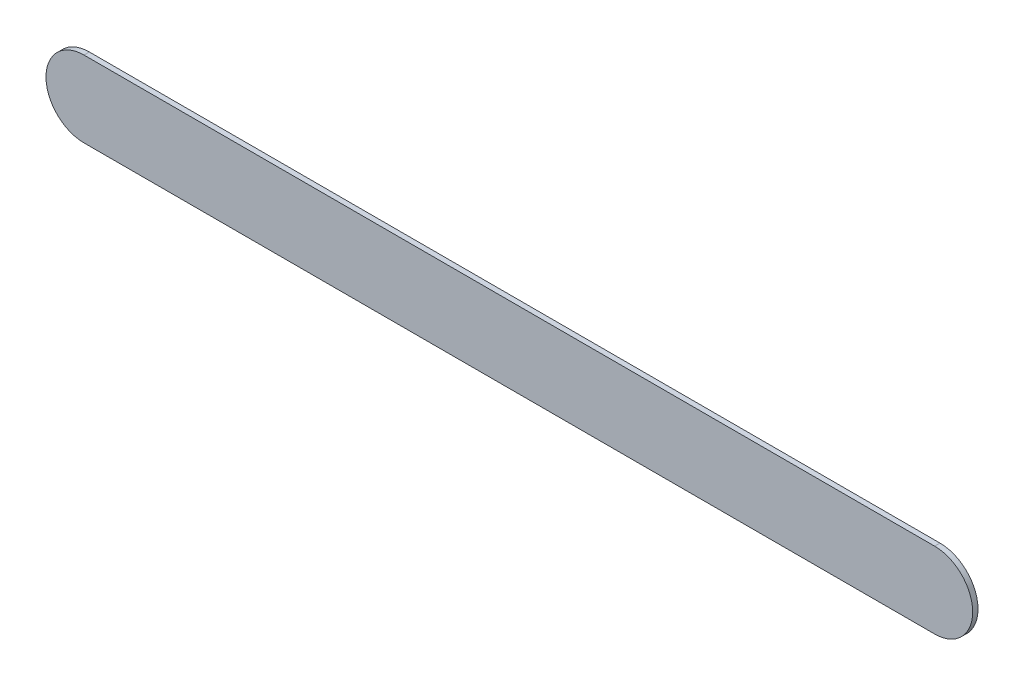
ISO-10303-21;
HEADER;
FILE_DESCRIPTION(('STEP AP214'),'2;1');
FILE_NAME('part.step','',(''),(''),'','','');
FILE_SCHEMA(('AUTOMOTIVE_DESIGN { 1 0 10303 214 1 1 1 1 }'));
ENDSEC;
DATA;
#1=APPLICATION_CONTEXT('core data for automotive mechanical design processes');
#2=APPLICATION_PROTOCOL_DEFINITION('international standard','automotive_design',2000,#1);
#3=PRODUCT_CONTEXT('',#1,'mechanical');
#4=PRODUCT('Part','Part','',(#3));
#5=PRODUCT_RELATED_PRODUCT_CATEGORY('part','',(#4));
#6=PRODUCT_DEFINITION_FORMATION('','',#4);
#7=PRODUCT_DEFINITION_CONTEXT('part definition',#1,'design');
#8=PRODUCT_DEFINITION('design','',#6,#7);
#9=PRODUCT_DEFINITION_SHAPE('','',#8);
#10=(LENGTH_UNIT() NAMED_UNIT(*) SI_UNIT(.MILLI.,.METRE.));
#11=(NAMED_UNIT(*) PLANE_ANGLE_UNIT() SI_UNIT($,.RADIAN.));
#12=(NAMED_UNIT(*) SI_UNIT($,.STERADIAN.) SOLID_ANGLE_UNIT());
#13=UNCERTAINTY_MEASURE_WITH_UNIT(LENGTH_MEASURE(1.E-05),#10,'distance_accuracy_value','');
#14=(GEOMETRIC_REPRESENTATION_CONTEXT(3) GLOBAL_UNCERTAINTY_ASSIGNED_CONTEXT((#13)) GLOBAL_UNIT_ASSIGNED_CONTEXT((#10,
#11,#12)) REPRESENTATION_CONTEXT('',''));
#15=CARTESIAN_POINT('',(0.,0.,0.));
#16=DIRECTION('',(0.,0.,1.));
#17=DIRECTION('',(1.,0.,0.));
#18=AXIS2_PLACEMENT_3D('',#15,#16,#17);
#19=CARTESIAN_POINT('',(137.922,-110.232,0.));
#20=DIRECTION('',(0.,0.,1.));
#21=DIRECTION('',(1.,0.,0.));
#22=AXIS2_PLACEMENT_3D('',#19,#20,#21);
#23=PLANE('',#22);
#24=DIRECTION('',(1.,0.,0.));
#25=VECTOR('',#24,1.);
#26=CARTESIAN_POINT('',(137.922,-110.232,0.));
#27=LINE('',#26,#25);
#28=CARTESIAN_POINT('',(137.922,-110.232,0.));
#29=VERTEX_POINT('',#28);
#30=CARTESIAN_POINT('',(143.51,-110.232,0.));
#31=VERTEX_POINT('',#30);
#32=EDGE_CURVE('E83',#29,#31,#27,.T.);
#33=ORIENTED_EDGE('',*,*,#32,.T.);
#34=CARTESIAN_POINT('',(143.51,-109.982,0.));
#35=DIRECTION('',(0.,0.,1.));
#36=DIRECTION('',(0.,-1.,0.));
#37=AXIS2_PLACEMENT_3D('',#34,#35,#36);
#38=CIRCLE('',#37,0.25);
#39=CARTESIAN_POINT('',(143.51,-109.732,0.));
#40=VERTEX_POINT('',#39);
#41=EDGE_CURVE('E107',#31,#40,#38,.T.);
#42=ORIENTED_EDGE('',*,*,#41,.T.);
#43=DIRECTION('',(-1.,0.,0.));
#44=VECTOR('',#43,1.);
#45=CARTESIAN_POINT('',(143.51,-109.732,0.));
#46=LINE('',#45,#44);
#47=CARTESIAN_POINT('',(137.922,-109.732,0.));
#48=VERTEX_POINT('',#47);
#49=EDGE_CURVE('E76',#40,#48,#46,.T.);
#50=ORIENTED_EDGE('',*,*,#49,.T.);
#51=CARTESIAN_POINT('',(137.922,-109.982,0.));
#52=DIRECTION('',(0.,0.,1.));
#53=DIRECTION('',(0.,1.,0.));
#54=AXIS2_PLACEMENT_3D('',#51,#52,#53);
#55=CIRCLE('',#54,0.25);
#56=EDGE_CURVE('E11',#48,#29,#55,.T.);
#57=ORIENTED_EDGE('',*,*,#56,.T.);
#58=EDGE_LOOP('',(#33,#42,#50,#57));
#59=FACE_BOUND('',#58,.T.);
#60=ADVANCED_FACE('F17',(#59),#23,.T.);
#61=CARTESIAN_POINT('',(137.922,-110.232,-0.035));
#62=DIRECTION('',(0.,0.,1.));
#63=DIRECTION('',(1.,0.,0.));
#64=AXIS2_PLACEMENT_3D('',#61,#62,#63);
#65=PLANE('',#64);
#66=CARTESIAN_POINT('',(137.922,-109.982,-0.035));
#67=DIRECTION('',(0.,0.,1.));
#68=DIRECTION('',(0.,1.,0.));
#69=AXIS2_PLACEMENT_3D('',#66,#67,#68);
#70=CIRCLE('',#69,0.25);
#71=CARTESIAN_POINT('',(137.922,-109.732,-0.035));
#72=VERTEX_POINT('',#71);
#73=CARTESIAN_POINT('',(137.922,-110.232,-0.035));
#74=VERTEX_POINT('',#73);
#75=EDGE_CURVE('E27',#72,#74,#70,.T.);
#76=ORIENTED_EDGE('',*,*,#75,.F.);
#77=DIRECTION('',(-1.,0.,0.));
#78=VECTOR('',#77,1.);
#79=CARTESIAN_POINT('',(143.51,-109.732,-0.035));
#80=LINE('',#79,#78);
#81=CARTESIAN_POINT('',(143.51,-109.732,-0.035));
#82=VERTEX_POINT('',#81);
#83=EDGE_CURVE('E112',#82,#72,#80,.T.);
#84=ORIENTED_EDGE('',*,*,#83,.F.);
#85=CARTESIAN_POINT('',(143.51,-109.982,-0.035));
#86=DIRECTION('',(0.,0.,1.));
#87=DIRECTION('',(0.,-1.,0.));
#88=AXIS2_PLACEMENT_3D('',#85,#86,#87);
#89=CIRCLE('',#88,0.25);
#90=CARTESIAN_POINT('',(143.51,-110.232,-0.035));
#91=VERTEX_POINT('',#90);
#92=EDGE_CURVE('E85',#91,#82,#89,.T.);
#93=ORIENTED_EDGE('',*,*,#92,.F.);
#94=DIRECTION('',(1.,0.,0.));
#95=VECTOR('',#94,1.);
#96=CARTESIAN_POINT('',(137.922,-110.232,-0.035));
#97=LINE('',#96,#95);
#98=EDGE_CURVE('E81',#74,#91,#97,.T.);
#99=ORIENTED_EDGE('',*,*,#98,.F.);
#100=EDGE_LOOP('',(#76,#84,#93,#99));
#101=FACE_BOUND('',#100,.T.);
#102=ADVANCED_FACE('F19',(#101),#65,.F.);
#103=CARTESIAN_POINT('',(137.922,-109.982,-0.035));
#104=DIRECTION('',(0.,0.,-1.));
#105=DIRECTION('',(0.,1.,0.));
#106=AXIS2_PLACEMENT_3D('',#103,#104,#105);
#107=CYLINDRICAL_SURFACE('',#106,0.25);
#108=ORIENTED_EDGE('',*,*,#75,.T.);
#109=DIRECTION('',(0.,0.,1.));
#110=VECTOR('',#109,1.);
#111=CARTESIAN_POINT('',(137.922,-110.232,-0.035));
#112=LINE('',#111,#110);
#113=EDGE_CURVE('E71',#74,#29,#112,.T.);
#114=ORIENTED_EDGE('',*,*,#113,.T.);
#115=ORIENTED_EDGE('',*,*,#56,.F.);
#116=DIRECTION('',(0.,0.,1.));
#117=VECTOR('',#116,1.);
#118=CARTESIAN_POINT('',(137.922,-109.732,-0.035));
#119=LINE('',#118,#117);
#120=EDGE_CURVE('E21',#72,#48,#119,.T.);
#121=ORIENTED_EDGE('',*,*,#120,.F.);
#122=EDGE_LOOP('',(#108,#114,#115,#121));
#123=FACE_BOUND('',#122,.T.);
#124=ADVANCED_FACE('F70',(#123),#107,.T.);
#125=CARTESIAN_POINT('',(143.51,-109.732,-0.035));
#126=DIRECTION('',(0.,-1.,0.));
#127=DIRECTION('',(0.,0.,-1.));
#128=AXIS2_PLACEMENT_3D('',#125,#126,#127);
#129=PLANE('',#128);
#130=ORIENTED_EDGE('',*,*,#83,.T.);
#131=ORIENTED_EDGE('',*,*,#120,.T.);
#132=ORIENTED_EDGE('',*,*,#49,.F.);
#133=DIRECTION('',(0.,0.,1.));
#134=VECTOR('',#133,1.);
#135=CARTESIAN_POINT('',(143.51,-109.732,-0.035));
#136=LINE('',#135,#134);
#137=EDGE_CURVE('E104',#82,#40,#136,.T.);
#138=ORIENTED_EDGE('',*,*,#137,.F.);
#139=EDGE_LOOP('',(#130,#131,#132,#138));
#140=FACE_BOUND('',#139,.T.);
#141=ADVANCED_FACE('F121',(#140),#129,.F.);
#142=CARTESIAN_POINT('',(143.51,-109.982,-0.035));
#143=DIRECTION('',(0.,0.,-1.));
#144=DIRECTION('',(0.,-1.,0.));
#145=AXIS2_PLACEMENT_3D('',#142,#143,#144);
#146=CYLINDRICAL_SURFACE('',#145,0.25);
#147=ORIENTED_EDGE('',*,*,#92,.T.);
#148=ORIENTED_EDGE('',*,*,#137,.T.);
#149=ORIENTED_EDGE('',*,*,#41,.F.);
#150=DIRECTION('',(0.,0.,1.));
#151=VECTOR('',#150,1.);
#152=CARTESIAN_POINT('',(143.51,-110.232,-0.035));
#153=LINE('',#152,#151);
#154=EDGE_CURVE('E90',#91,#31,#153,.T.);
#155=ORIENTED_EDGE('',*,*,#154,.F.);
#156=EDGE_LOOP('',(#147,#148,#149,#155));
#157=FACE_BOUND('',#156,.T.);
#158=ADVANCED_FACE('F124',(#157),#146,.T.);
#159=CARTESIAN_POINT('',(137.922,-110.232,-0.035));
#160=DIRECTION('',(0.,1.,0.));
#161=DIRECTION('',(1.,0.,0.));
#162=AXIS2_PLACEMENT_3D('',#159,#160,#161);
#163=PLANE('',#162);
#164=ORIENTED_EDGE('',*,*,#98,.T.);
#165=ORIENTED_EDGE('',*,*,#154,.T.);
#166=ORIENTED_EDGE('',*,*,#32,.F.);
#167=ORIENTED_EDGE('',*,*,#113,.F.);
#168=EDGE_LOOP('',(#164,#165,#166,#167));
#169=FACE_BOUND('',#168,.T.);
#170=ADVANCED_FACE('F79',(#169),#163,.F.);
#171=CLOSED_SHELL('',(#60,#102,#124,#141,#158,#170));
#172=MANIFOLD_SOLID_BREP('B1',#171);
#173=ADVANCED_BREP_SHAPE_REPRESENTATION('',(#18,#172),#14);
#174=SHAPE_DEFINITION_REPRESENTATION(#9,#173);
ENDSEC;
END-ISO-10303-21;
